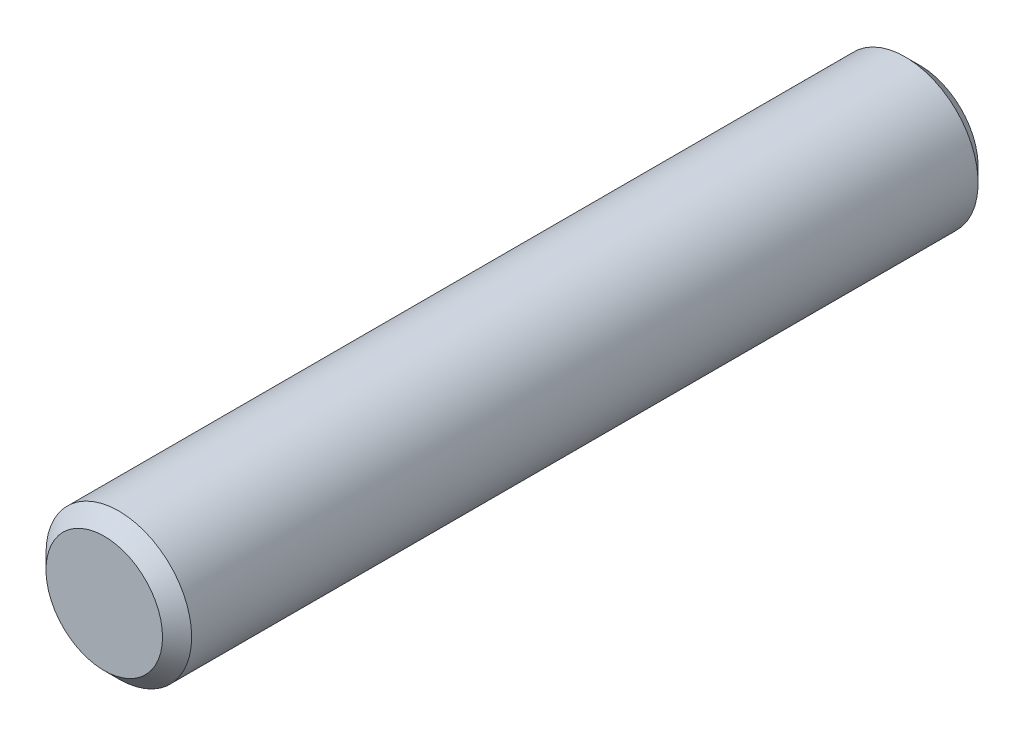
ISO-10303-21;
HEADER;
FILE_DESCRIPTION(('STEP AP214'),'2;1');
FILE_NAME('part.step','',(''),(''),'','','');
FILE_SCHEMA(('AUTOMOTIVE_DESIGN { 1 0 10303 214 1 1 1 1 }'));
ENDSEC;
DATA;
#1=APPLICATION_CONTEXT('core data for automotive mechanical design processes');
#2=APPLICATION_PROTOCOL_DEFINITION('international standard','automotive_design',2000,#1);
#3=PRODUCT_CONTEXT('',#1,'mechanical');
#4=PRODUCT('Part','Part','',(#3));
#5=PRODUCT_RELATED_PRODUCT_CATEGORY('part','',(#4));
#6=PRODUCT_DEFINITION_FORMATION('','',#4);
#7=PRODUCT_DEFINITION_CONTEXT('part definition',#1,'design');
#8=PRODUCT_DEFINITION('design','',#6,#7);
#9=PRODUCT_DEFINITION_SHAPE('','',#8);
#10=(LENGTH_UNIT() NAMED_UNIT(*) SI_UNIT(.MILLI.,.METRE.));
#11=(NAMED_UNIT(*) PLANE_ANGLE_UNIT() SI_UNIT($,.RADIAN.));
#12=(NAMED_UNIT(*) SI_UNIT($,.STERADIAN.) SOLID_ANGLE_UNIT());
#13=UNCERTAINTY_MEASURE_WITH_UNIT(LENGTH_MEASURE(1.E-05),#10,'distance_accuracy_value','');
#14=(GEOMETRIC_REPRESENTATION_CONTEXT(3) GLOBAL_UNCERTAINTY_ASSIGNED_CONTEXT((#13)) GLOBAL_UNIT_ASSIGNED_CONTEXT((#10,
#11,#12)) REPRESENTATION_CONTEXT('',''));
#15=CARTESIAN_POINT('',(0.,0.,0.));
#16=DIRECTION('',(0.,0.,1.));
#17=DIRECTION('',(1.,0.,0.));
#18=AXIS2_PLACEMENT_3D('',#15,#16,#17);
#19=CARTESIAN_POINT('',(0.,0.,28.));
#20=DIRECTION('',(0.,0.,-1.));
#21=DIRECTION('',(-1.,0.,0.));
#22=AXIS2_PLACEMENT_3D('',#19,#20,#21);
#23=CYLINDRICAL_SURFACE('',#22,2.5);
#24=CARTESIAN_POINT('',(0.,0.,27.5));
#25=DIRECTION('',(0.,0.,1.));
#26=DIRECTION('',(1.,0.,0.));
#27=AXIS2_PLACEMENT_3D('',#24,#25,#26);
#28=CIRCLE('',#27,2.5);
#29=CARTESIAN_POINT('',(2.5,0.,27.5));
#30=VERTEX_POINT('',#29);
#31=EDGE_CURVE('E42',#30,#30,#28,.F.);
#32=ORIENTED_EDGE('',*,*,#31,.T.);
#33=EDGE_LOOP('',(#32));
#34=FACE_BOUND('',#33,.T.);
#35=CARTESIAN_POINT('',(0.,0.,0.499999999999997));
#36=DIRECTION('',(0.,0.,-1.));
#37=DIRECTION('',(-1.,0.,0.));
#38=AXIS2_PLACEMENT_3D('',#35,#36,#37);
#39=CIRCLE('',#38,2.5);
#40=CARTESIAN_POINT('',(-2.5,0.,0.499999999999997));
#41=VERTEX_POINT('',#40);
#42=EDGE_CURVE('E46',#41,#41,#39,.F.);
#43=ORIENTED_EDGE('',*,*,#42,.T.);
#44=EDGE_LOOP('',(#43));
#45=FACE_BOUND('',#44,.T.);
#46=ADVANCED_FACE('F31',(#34,#45),#23,.T.);
#47=CARTESIAN_POINT('',(2.5,0.,28.));
#48=DIRECTION('',(0.,0.,1.));
#49=DIRECTION('',(1.,0.,0.));
#50=AXIS2_PLACEMENT_3D('',#47,#48,#49);
#51=PLANE('',#50);
#52=CARTESIAN_POINT('',(0.,0.,28.));
#53=DIRECTION('',(0.,0.,1.));
#54=DIRECTION('',(1.,0.,0.));
#55=AXIS2_PLACEMENT_3D('',#52,#53,#54);
#56=CIRCLE('',#55,2.);
#57=CARTESIAN_POINT('',(2.,0.,28.));
#58=VERTEX_POINT('',#57);
#59=EDGE_CURVE('E38',#58,#58,#56,.T.);
#60=ORIENTED_EDGE('',*,*,#59,.T.);
#61=EDGE_LOOP('',(#60));
#62=FACE_BOUND('',#61,.T.);
#63=ADVANCED_FACE('F62',(#62),#51,.T.);
#64=CARTESIAN_POINT('',(0.,0.,0.));
#65=DIRECTION('',(0.,0.,-1.));
#66=DIRECTION('',(-1.,0.,0.));
#67=AXIS2_PLACEMENT_3D('',#64,#65,#66);
#68=PLANE('',#67);
#69=CARTESIAN_POINT('',(0.,0.,0.));
#70=DIRECTION('',(0.,0.,-1.));
#71=DIRECTION('',(-1.,0.,0.));
#72=AXIS2_PLACEMENT_3D('',#69,#70,#71);
#73=CIRCLE('',#72,2.);
#74=CARTESIAN_POINT('',(-2.,0.,0.));
#75=VERTEX_POINT('',#74);
#76=EDGE_CURVE('E10',#75,#75,#73,.T.);
#77=ORIENTED_EDGE('',*,*,#76,.T.);
#78=EDGE_LOOP('',(#77));
#79=FACE_BOUND('',#78,.T.);
#80=ADVANCED_FACE('F59',(#79),#68,.T.);
#81=CARTESIAN_POINT('',(0.,0.,27.5));
#82=DIRECTION('',(0.,0.,-1.));
#83=DIRECTION('',(-1.,0.,0.));
#84=AXIS2_PLACEMENT_3D('',#81,#82,#83);
#85=CONICAL_SURFACE('',#84,2.5,0.785398163397452);
#86=ORIENTED_EDGE('',*,*,#59,.F.);
#87=EDGE_LOOP('',(#86));
#88=FACE_BOUND('',#87,.T.);
#89=ORIENTED_EDGE('',*,*,#31,.F.);
#90=EDGE_LOOP('',(#89));
#91=FACE_BOUND('',#90,.T.);
#92=ADVANCED_FACE('F55',(#88,#91),#85,.T.);
#93=CARTESIAN_POINT('',(0.,0.,0.));
#94=DIRECTION('',(0.,0.,1.));
#95=DIRECTION('',(1.,0.,0.));
#96=AXIS2_PLACEMENT_3D('',#93,#94,#95);
#97=CONICAL_SURFACE('',#96,2.,0.785398163397448);
#98=ORIENTED_EDGE('',*,*,#42,.F.);
#99=EDGE_LOOP('',(#98));
#100=FACE_BOUND('',#99,.T.);
#101=ORIENTED_EDGE('',*,*,#76,.F.);
#102=EDGE_LOOP('',(#101));
#103=FACE_BOUND('',#102,.T.);
#104=ADVANCED_FACE('F33',(#100,#103),#97,.T.);
#105=CLOSED_SHELL('',(#46,#63,#80,#92,#104));
#106=MANIFOLD_SOLID_BREP('B2',#105);
#107=ADVANCED_BREP_SHAPE_REPRESENTATION('',(#18,#106),#14);
#108=SHAPE_DEFINITION_REPRESENTATION(#9,#107);
ENDSEC;
END-ISO-10303-21;
